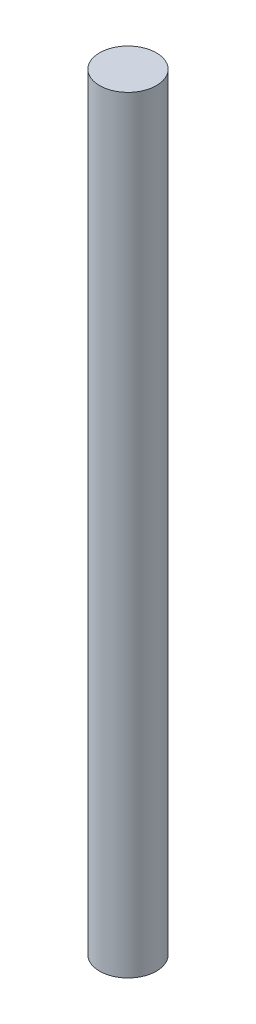
ISO-10303-21;
HEADER;
FILE_DESCRIPTION(('STEP AP214'),'2;1');
FILE_NAME('part.step','',(''),(''),'','','');
FILE_SCHEMA(('AUTOMOTIVE_DESIGN { 1 0 10303 214 1 1 1 1 }'));
ENDSEC;
DATA;
#1=APPLICATION_CONTEXT('core data for automotive mechanical design processes');
#2=APPLICATION_PROTOCOL_DEFINITION('international standard','automotive_design',2000,#1);
#3=PRODUCT_CONTEXT('',#1,'mechanical');
#4=PRODUCT('Part','Part','',(#3));
#5=PRODUCT_RELATED_PRODUCT_CATEGORY('part','',(#4));
#6=PRODUCT_DEFINITION_FORMATION('','',#4);
#7=PRODUCT_DEFINITION_CONTEXT('part definition',#1,'design');
#8=PRODUCT_DEFINITION('design','',#6,#7);
#9=PRODUCT_DEFINITION_SHAPE('','',#8);
#10=(LENGTH_UNIT() NAMED_UNIT(*) SI_UNIT(.MILLI.,.METRE.));
#11=(NAMED_UNIT(*) PLANE_ANGLE_UNIT() SI_UNIT($,.RADIAN.));
#12=(NAMED_UNIT(*) SI_UNIT($,.STERADIAN.) SOLID_ANGLE_UNIT());
#13=UNCERTAINTY_MEASURE_WITH_UNIT(LENGTH_MEASURE(1.E-05),#10,'distance_accuracy_value','');
#14=(GEOMETRIC_REPRESENTATION_CONTEXT(3) GLOBAL_UNCERTAINTY_ASSIGNED_CONTEXT((#13)) GLOBAL_UNIT_ASSIGNED_CONTEXT((#10,
#11,#12)) REPRESENTATION_CONTEXT('',''));
#15=CARTESIAN_POINT('',(0.,0.,0.));
#16=DIRECTION('',(0.,0.,1.));
#17=DIRECTION('',(1.,0.,0.));
#18=AXIS2_PLACEMENT_3D('',#15,#16,#17);
#19=CARTESIAN_POINT('',(0.,135.,0.));
#20=DIRECTION('',(0.,-1.,0.));
#21=DIRECTION('',(0.,0.,-1.));
#22=AXIS2_PLACEMENT_3D('',#19,#20,#21);
#23=CYLINDRICAL_SURFACE('',#22,5.);
#24=CARTESIAN_POINT('',(0.,135.,0.));
#25=DIRECTION('',(0.,1.,0.));
#26=DIRECTION('',(0.,0.,1.));
#27=AXIS2_PLACEMENT_3D('',#24,#25,#26);
#28=CIRCLE('',#27,5.);
#29=CARTESIAN_POINT('',(0.,135.,5.));
#30=VERTEX_POINT('',#29);
#31=EDGE_CURVE('E10',#30,#30,#28,.T.);
#32=ORIENTED_EDGE('',*,*,#31,.F.);
#33=EDGE_LOOP('',(#32));
#34=FACE_BOUND('',#33,.T.);
#35=CARTESIAN_POINT('',(0.,0.,0.));
#36=DIRECTION('',(0.,1.,0.));
#37=DIRECTION('',(0.,0.,1.));
#38=AXIS2_PLACEMENT_3D('',#35,#36,#37);
#39=CIRCLE('',#38,5.);
#40=CARTESIAN_POINT('',(0.,0.,5.));
#41=VERTEX_POINT('',#40);
#42=EDGE_CURVE('E40',#41,#41,#39,.T.);
#43=ORIENTED_EDGE('',*,*,#42,.T.);
#44=EDGE_LOOP('',(#43));
#45=FACE_BOUND('',#44,.T.);
#46=ADVANCED_FACE('F37',(#34,#45),#23,.T.);
#47=CARTESIAN_POINT('',(0.,135.,0.));
#48=DIRECTION('',(0.,1.,0.));
#49=DIRECTION('',(0.,0.,1.));
#50=AXIS2_PLACEMENT_3D('',#47,#48,#49);
#51=PLANE('',#50);
#52=ORIENTED_EDGE('',*,*,#31,.T.);
#53=EDGE_LOOP('',(#52));
#54=FACE_BOUND('',#53,.T.);
#55=ADVANCED_FACE('F54',(#54),#51,.T.);
#56=CARTESIAN_POINT('',(0.,0.,0.));
#57=DIRECTION('',(0.,1.,0.));
#58=DIRECTION('',(0.,0.,1.));
#59=AXIS2_PLACEMENT_3D('',#56,#57,#58);
#60=PLANE('',#59);
#61=ORIENTED_EDGE('',*,*,#42,.F.);
#62=EDGE_LOOP('',(#61));
#63=FACE_BOUND('',#62,.T.);
#64=ADVANCED_FACE('F52',(#63),#60,.F.);
#65=CLOSED_SHELL('',(#46,#55,#64));
#66=MANIFOLD_SOLID_BREP('B2',#65);
#67=ADVANCED_BREP_SHAPE_REPRESENTATION('',(#18,#66),#14);
#68=SHAPE_DEFINITION_REPRESENTATION(#9,#67);
ENDSEC;
END-ISO-10303-21;
